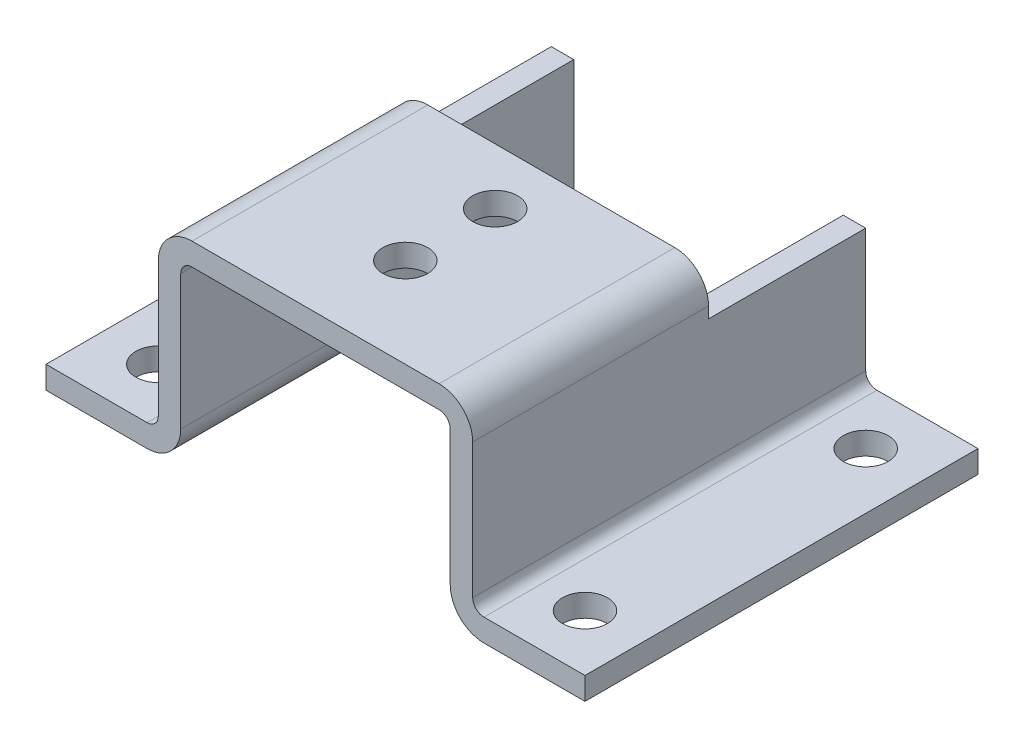
ISO-10303-21;
HEADER;
FILE_DESCRIPTION(('STEP AP214'),'2;1');
FILE_NAME('part.step','',(''),(''),'','','');
FILE_SCHEMA(('AUTOMOTIVE_DESIGN { 1 0 10303 214 1 1 1 1 }'));
ENDSEC;
DATA;
#1=APPLICATION_CONTEXT('core data for automotive mechanical design processes');
#2=APPLICATION_PROTOCOL_DEFINITION('international standard','automotive_design',2000,#1);
#3=PRODUCT_CONTEXT('',#1,'mechanical');
#4=PRODUCT('Part','Part','',(#3));
#5=PRODUCT_RELATED_PRODUCT_CATEGORY('part','',(#4));
#6=PRODUCT_DEFINITION_FORMATION('','',#4);
#7=PRODUCT_DEFINITION_CONTEXT('part definition',#1,'design');
#8=PRODUCT_DEFINITION('design','',#6,#7);
#9=PRODUCT_DEFINITION_SHAPE('','',#8);
#10=(LENGTH_UNIT() NAMED_UNIT(*) SI_UNIT(.MILLI.,.METRE.));
#11=(NAMED_UNIT(*) PLANE_ANGLE_UNIT() SI_UNIT($,.RADIAN.));
#12=(NAMED_UNIT(*) SI_UNIT($,.STERADIAN.) SOLID_ANGLE_UNIT());
#13=UNCERTAINTY_MEASURE_WITH_UNIT(LENGTH_MEASURE(1.E-05),#10,'distance_accuracy_value','');
#14=(GEOMETRIC_REPRESENTATION_CONTEXT(3) GLOBAL_UNCERTAINTY_ASSIGNED_CONTEXT((#13)) GLOBAL_UNIT_ASSIGNED_CONTEXT((#10,
#11,#12)) REPRESENTATION_CONTEXT('',''));
#15=CARTESIAN_POINT('',(0.,0.,0.));
#16=DIRECTION('',(0.,0.,1.));
#17=DIRECTION('',(1.,0.,0.));
#18=AXIS2_PLACEMENT_3D('',#15,#16,#17);
#19=CARTESIAN_POINT('',(9.,3.,0.));
#20=DIRECTION('',(0.,0.,1.));
#21=DIRECTION('',(1.,0.,0.));
#22=AXIS2_PLACEMENT_3D('',#19,#20,#21);
#23=PLANE('',#22);
#24=DIRECTION('',(-1.,0.,0.));
#25=VECTOR('',#24,1.);
#26=CARTESIAN_POINT('',(9.,14.,0.));
#27=LINE('',#26,#25);
#28=CARTESIAN_POINT('',(38.,14.,0.));
#29=VERTEX_POINT('',#28);
#30=CARTESIAN_POINT('',(36.,14.,0.));
#31=VERTEX_POINT('',#30);
#32=EDGE_CURVE('E54',#29,#31,#27,.T.);
#33=ORIENTED_EDGE('',*,*,#32,.F.);
#34=DIRECTION('',(0.,1.,0.));
#35=VECTOR('',#34,1.);
#36=CARTESIAN_POINT('',(38.,3.00000000000001,0.));
#37=LINE('',#36,#35);
#38=CARTESIAN_POINT('',(38.,3.00000000000001,0.));
#39=VERTEX_POINT('',#38);
#40=EDGE_CURVE('E228',#39,#29,#37,.T.);
#41=ORIENTED_EDGE('',*,*,#40,.F.);
#42=CARTESIAN_POINT('',(39.,3.00000000000001,0.));
#43=DIRECTION('',(0.,0.,-1.));
#44=DIRECTION('',(-1.,0.,0.));
#45=AXIS2_PLACEMENT_3D('',#42,#43,#44);
#46=CIRCLE('',#45,1.);
#47=CARTESIAN_POINT('',(39.,2.00000000000001,0.));
#48=VERTEX_POINT('',#47);
#49=EDGE_CURVE('E226',#48,#39,#46,.T.);
#50=ORIENTED_EDGE('',*,*,#49,.F.);
#51=DIRECTION('',(-1.,0.,0.));
#52=VECTOR('',#51,1.);
#53=CARTESIAN_POINT('',(48.,2.00000000000001,0.));
#54=LINE('',#53,#52);
#55=CARTESIAN_POINT('',(48.,2.00000000000001,0.));
#56=VERTEX_POINT('',#55);
#57=EDGE_CURVE('E224',#56,#48,#54,.T.);
#58=ORIENTED_EDGE('',*,*,#57,.F.);
#59=DIRECTION('',(0.,1.,0.));
#60=VECTOR('',#59,1.);
#61=CARTESIAN_POINT('',(48.,0.,0.));
#62=LINE('',#61,#60);
#63=CARTESIAN_POINT('',(48.,0.,0.));
#64=VERTEX_POINT('',#63);
#65=EDGE_CURVE('E222',#64,#56,#62,.T.);
#66=ORIENTED_EDGE('',*,*,#65,.F.);
#67=DIRECTION('',(1.,0.,0.));
#68=VECTOR('',#67,1.);
#69=CARTESIAN_POINT('',(39.,0.,0.));
#70=LINE('',#69,#68);
#71=CARTESIAN_POINT('',(39.,0.,0.));
#72=VERTEX_POINT('',#71);
#73=EDGE_CURVE('E220',#72,#64,#70,.T.);
#74=ORIENTED_EDGE('',*,*,#73,.F.);
#75=CARTESIAN_POINT('',(39.,3.00000000000001,0.));
#76=DIRECTION('',(0.,0.,1.));
#77=DIRECTION('',(-1.,0.,0.));
#78=AXIS2_PLACEMENT_3D('',#75,#76,#77);
#79=CIRCLE('',#78,3.);
#80=CARTESIAN_POINT('',(36.,3.00000000000001,0.));
#81=VERTEX_POINT('',#80);
#82=EDGE_CURVE('E218',#81,#72,#79,.T.);
#83=ORIENTED_EDGE('',*,*,#82,.F.);
#84=DIRECTION('',(0.,-1.,0.));
#85=VECTOR('',#84,1.);
#86=CARTESIAN_POINT('',(36.,15.,0.));
#87=LINE('',#86,#85);
#88=EDGE_CURVE('E216',#31,#81,#87,.T.);
#89=ORIENTED_EDGE('',*,*,#88,.F.);
#90=EDGE_LOOP('',(#33,#41,#50,#58,#66,#74,#83,#89));
#91=FACE_BOUND('',#90,.T.);
#92=ADVANCED_FACE('F45',(#91),#23,.F.);
#93=CARTESIAN_POINT('',(12.,14.,0.));
#94=VERTEX_POINT('',#93);
#95=CARTESIAN_POINT('',(10.,14.,0.));
#96=VERTEX_POINT('',#95);
#97=EDGE_CURVE('E286',#94,#96,#27,.T.);
#98=ORIENTED_EDGE('',*,*,#97,.F.);
#99=DIRECTION('',(0.,1.,0.));
#100=VECTOR('',#99,1.);
#101=CARTESIAN_POINT('',(12.,3.,0.));
#102=LINE('',#101,#100);
#103=CARTESIAN_POINT('',(12.,3.,0.));
#104=VERTEX_POINT('',#103);
#105=EDGE_CURVE('E213',#104,#94,#102,.T.);
#106=ORIENTED_EDGE('',*,*,#105,.F.);
#107=CARTESIAN_POINT('',(9.,3.,0.));
#108=DIRECTION('',(0.,0.,1.));
#109=DIRECTION('',(1.,0.,0.));
#110=AXIS2_PLACEMENT_3D('',#107,#108,#109);
#111=CIRCLE('',#110,3.);
#112=CARTESIAN_POINT('',(9.,0.,0.));
#113=VERTEX_POINT('',#112);
#114=EDGE_CURVE('E211',#113,#104,#111,.T.);
#115=ORIENTED_EDGE('',*,*,#114,.F.);
#116=DIRECTION('',(1.,0.,0.));
#117=VECTOR('',#116,1.);
#118=CARTESIAN_POINT('',(0.,0.,0.));
#119=LINE('',#118,#117);
#120=CARTESIAN_POINT('',(0.,0.,0.));
#121=VERTEX_POINT('',#120);
#122=EDGE_CURVE('E208',#121,#113,#119,.T.);
#123=ORIENTED_EDGE('',*,*,#122,.F.);
#124=DIRECTION('',(0.,-1.,0.));
#125=VECTOR('',#124,1.);
#126=CARTESIAN_POINT('',(0.,2.,0.));
#127=LINE('',#126,#125);
#128=CARTESIAN_POINT('',(0.,2.,0.));
#129=VERTEX_POINT('',#128);
#130=EDGE_CURVE('E205',#129,#121,#127,.T.);
#131=ORIENTED_EDGE('',*,*,#130,.F.);
#132=DIRECTION('',(-1.,0.,0.));
#133=VECTOR('',#132,1.);
#134=CARTESIAN_POINT('',(9.,2.,0.));
#135=LINE('',#134,#133);
#136=CARTESIAN_POINT('',(9.,2.,0.));
#137=VERTEX_POINT('',#136);
#138=EDGE_CURVE('E116',#137,#129,#135,.T.);
#139=ORIENTED_EDGE('',*,*,#138,.F.);
#140=CARTESIAN_POINT('',(9.,3.,0.));
#141=DIRECTION('',(0.,0.,-1.));
#142=DIRECTION('',(1.,0.,0.));
#143=AXIS2_PLACEMENT_3D('',#140,#141,#142);
#144=CIRCLE('',#143,1.);
#145=CARTESIAN_POINT('',(10.,3.,0.));
#146=VERTEX_POINT('',#145);
#147=EDGE_CURVE('E232',#146,#137,#144,.T.);
#148=ORIENTED_EDGE('',*,*,#147,.F.);
#149=DIRECTION('',(0.,-1.,0.));
#150=VECTOR('',#149,1.);
#151=CARTESIAN_POINT('',(10.,15.,0.));
#152=LINE('',#151,#150);
#153=EDGE_CURVE('E193',#96,#146,#152,.T.);
#154=ORIENTED_EDGE('',*,*,#153,.F.);
#155=EDGE_LOOP('',(#98,#106,#115,#123,#131,#139,#148,#154));
#156=FACE_BOUND('',#155,.T.);
#157=ADVANCED_FACE('F431',(#156),#23,.F.);
#158=CARTESIAN_POINT('',(0.,2.,35.));
#159=DIRECTION('',(1.,0.,0.));
#160=DIRECTION('',(0.,1.,0.));
#161=AXIS2_PLACEMENT_3D('',#158,#159,#160);
#162=PLANE('',#161);
#163=ORIENTED_EDGE('',*,*,#130,.T.);
#164=DIRECTION('',(0.,0.,-1.));
#165=VECTOR('',#164,1.);
#166=CARTESIAN_POINT('',(0.,0.,35.));
#167=LINE('',#166,#165);
#168=CARTESIAN_POINT('',(0.,0.,35.));
#169=VERTEX_POINT('',#168);
#170=EDGE_CURVE('E284',#169,#121,#167,.T.);
#171=ORIENTED_EDGE('',*,*,#170,.F.);
#172=DIRECTION('',(0.,-1.,0.));
#173=VECTOR('',#172,1.);
#174=CARTESIAN_POINT('',(0.,2.,35.));
#175=LINE('',#174,#173);
#176=CARTESIAN_POINT('',(0.,2.,35.));
#177=VERTEX_POINT('',#176);
#178=EDGE_CURVE('E235',#177,#169,#175,.T.);
#179=ORIENTED_EDGE('',*,*,#178,.F.);
#180=DIRECTION('',(0.,0.,-1.));
#181=VECTOR('',#180,1.);
#182=CARTESIAN_POINT('',(0.,2.,35.));
#183=LINE('',#182,#181);
#184=EDGE_CURVE('E201',#177,#129,#183,.T.);
#185=ORIENTED_EDGE('',*,*,#184,.T.);
#186=EDGE_LOOP('',(#163,#171,#179,#185));
#187=FACE_BOUND('',#186,.T.);
#188=ADVANCED_FACE('F47',(#187),#162,.F.);
#189=CARTESIAN_POINT('',(0.,0.,35.));
#190=DIRECTION('',(0.,1.,0.));
#191=DIRECTION('',(-1.,0.,0.));
#192=AXIS2_PLACEMENT_3D('',#189,#190,#191);
#193=PLANE('',#192);
#194=CARTESIAN_POINT('',(4.99999999999999,0.,5.));
#195=DIRECTION('',(0.,1.,0.));
#196=DIRECTION('',(-1.,0.,0.));
#197=AXIS2_PLACEMENT_3D('',#194,#195,#196);
#198=CIRCLE('',#197,2.);
#199=CARTESIAN_POINT('',(2.99999999999999,0.,5.));
#200=VERTEX_POINT('',#199);
#201=EDGE_CURVE('E708',#200,#200,#198,.T.);
#202=ORIENTED_EDGE('',*,*,#201,.T.);
#203=EDGE_LOOP('',(#202));
#204=FACE_BOUND('',#203,.T.);
#205=CARTESIAN_POINT('',(5.,0.,30.));
#206=DIRECTION('',(0.,1.,0.));
#207=DIRECTION('',(-1.,0.,0.));
#208=AXIS2_PLACEMENT_3D('',#205,#206,#207);
#209=CIRCLE('',#208,2.);
#210=CARTESIAN_POINT('',(2.99999999999999,0.,30.));
#211=VERTEX_POINT('',#210);
#212=EDGE_CURVE('E712',#211,#211,#209,.T.);
#213=ORIENTED_EDGE('',*,*,#212,.T.);
#214=EDGE_LOOP('',(#213));
#215=FACE_BOUND('',#214,.T.);
#216=ORIENTED_EDGE('',*,*,#122,.T.);
#217=DIRECTION('',(0.,0.,-1.));
#218=VECTOR('',#217,1.);
#219=CARTESIAN_POINT('',(9.,0.,35.));
#220=LINE('',#219,#218);
#221=CARTESIAN_POINT('',(9.,0.,35.));
#222=VERTEX_POINT('',#221);
#223=EDGE_CURVE('E281',#222,#113,#220,.T.);
#224=ORIENTED_EDGE('',*,*,#223,.F.);
#225=DIRECTION('',(1.,0.,0.));
#226=VECTOR('',#225,1.);
#227=CARTESIAN_POINT('',(0.,0.,35.));
#228=LINE('',#227,#226);
#229=EDGE_CURVE('E125',#169,#222,#228,.T.);
#230=ORIENTED_EDGE('',*,*,#229,.F.);
#231=ORIENTED_EDGE('',*,*,#170,.T.);
#232=EDGE_LOOP('',(#216,#224,#230,#231));
#233=FACE_BOUND('',#232,.T.);
#234=ADVANCED_FACE('F565',(#204,#215,#233),#193,.F.);
#235=CARTESIAN_POINT('',(9.,3.,35.));
#236=DIRECTION('',(0.,0.,-1.));
#237=DIRECTION('',(-1.,0.,0.));
#238=AXIS2_PLACEMENT_3D('',#235,#236,#237);
#239=CYLINDRICAL_SURFACE('',#238,3.);
#240=ORIENTED_EDGE('',*,*,#114,.T.);
#241=DIRECTION('',(0.,0.,-1.));
#242=VECTOR('',#241,1.);
#243=CARTESIAN_POINT('',(12.,3.,35.));
#244=LINE('',#243,#242);
#245=CARTESIAN_POINT('',(12.,3.,35.));
#246=VERTEX_POINT('',#245);
#247=EDGE_CURVE('E278',#246,#104,#244,.T.);
#248=ORIENTED_EDGE('',*,*,#247,.F.);
#249=CARTESIAN_POINT('',(9.,3.,35.));
#250=DIRECTION('',(0.,0.,1.));
#251=DIRECTION('',(1.,0.,0.));
#252=AXIS2_PLACEMENT_3D('',#249,#250,#251);
#253=CIRCLE('',#252,3.);
#254=EDGE_CURVE('E351',#222,#246,#253,.T.);
#255=ORIENTED_EDGE('',*,*,#254,.F.);
#256=ORIENTED_EDGE('',*,*,#223,.T.);
#257=EDGE_LOOP('',(#240,#248,#255,#256));
#258=FACE_BOUND('',#257,.T.);
#259=ADVANCED_FACE('F568',(#258),#239,.T.);
#260=CARTESIAN_POINT('',(12.,3.,35.));
#261=DIRECTION('',(-1.,0.,0.));
#262=DIRECTION('',(0.,-1.,0.));
#263=AXIS2_PLACEMENT_3D('',#260,#261,#262);
#264=PLANE('',#263);
#265=DIRECTION('',(0.,0.,-1.));
#266=VECTOR('',#265,1.);
#267=CARTESIAN_POINT('',(12.,14.,35.));
#268=LINE('',#267,#266);
#269=CARTESIAN_POINT('',(12.,14.,14.));
#270=VERTEX_POINT('',#269);
#271=EDGE_CURVE('E62',#270,#94,#268,.T.);
#272=ORIENTED_EDGE('',*,*,#271,.F.);
#273=DIRECTION('',(0.,1.,0.));
#274=VECTOR('',#273,1.);
#275=CARTESIAN_POINT('',(12.,3.,14.));
#276=LINE('',#275,#274);
#277=CARTESIAN_POINT('',(12.,15.,14.));
#278=VERTEX_POINT('',#277);
#279=EDGE_CURVE('E209',#270,#278,#276,.T.);
#280=ORIENTED_EDGE('',*,*,#279,.T.);
#281=DIRECTION('',(0.,0.,-1.));
#282=VECTOR('',#281,1.);
#283=CARTESIAN_POINT('',(12.,15.,35.));
#284=LINE('',#283,#282);
#285=CARTESIAN_POINT('',(12.,15.,35.));
#286=VERTEX_POINT('',#285);
#287=EDGE_CURVE('E275',#286,#278,#284,.T.);
#288=ORIENTED_EDGE('',*,*,#287,.F.);
#289=DIRECTION('',(0.,1.,0.));
#290=VECTOR('',#289,1.);
#291=CARTESIAN_POINT('',(12.,3.,35.));
#292=LINE('',#291,#290);
#293=EDGE_CURVE('E353',#246,#286,#292,.T.);
#294=ORIENTED_EDGE('',*,*,#293,.F.);
#295=ORIENTED_EDGE('',*,*,#247,.T.);
#296=ORIENTED_EDGE('',*,*,#105,.T.);
#297=EDGE_LOOP('',(#272,#280,#288,#294,#295,#296));
#298=FACE_BOUND('',#297,.T.);
#299=ADVANCED_FACE('F419',(#298),#264,.F.);
#300=CARTESIAN_POINT('',(13.,15.,35.));
#301=DIRECTION('',(0.,0.,-1.));
#302=DIRECTION('',(-1.,0.,0.));
#303=AXIS2_PLACEMENT_3D('',#300,#301,#302);
#304=CYLINDRICAL_SURFACE('',#303,1.);
#305=ORIENTED_EDGE('',*,*,#287,.T.);
#306=CARTESIAN_POINT('',(13.,15.,14.));
#307=DIRECTION('',(0.,0.,1.));
#308=DIRECTION('',(1.,0.,0.));
#309=AXIS2_PLACEMENT_3D('',#306,#307,#308);
#310=CIRCLE('',#309,1.);
#311=CARTESIAN_POINT('',(13.,16.,14.));
#312=VERTEX_POINT('',#311);
#313=EDGE_CURVE('E344',#278,#312,#310,.F.);
#314=ORIENTED_EDGE('',*,*,#313,.T.);
#315=DIRECTION('',(0.,0.,-1.));
#316=VECTOR('',#315,1.);
#317=CARTESIAN_POINT('',(13.,16.,35.));
#318=LINE('',#317,#316);
#319=CARTESIAN_POINT('',(13.,16.,35.));
#320=VERTEX_POINT('',#319);
#321=EDGE_CURVE('E272',#320,#312,#318,.T.);
#322=ORIENTED_EDGE('',*,*,#321,.F.);
#323=CARTESIAN_POINT('',(13.,15.,35.));
#324=DIRECTION('',(0.,0.,-1.));
#325=DIRECTION('',(1.,0.,0.));
#326=AXIS2_PLACEMENT_3D('',#323,#324,#325);
#327=CIRCLE('',#326,1.);
#328=EDGE_CURVE('E355',#286,#320,#327,.T.);
#329=ORIENTED_EDGE('',*,*,#328,.F.);
#330=EDGE_LOOP('',(#305,#314,#322,#329));
#331=FACE_BOUND('',#330,.T.);
#332=ADVANCED_FACE('F422',(#331),#304,.F.);
#333=CARTESIAN_POINT('',(13.,16.,35.));
#334=DIRECTION('',(0.,1.,0.));
#335=DIRECTION('',(-1.,0.,0.));
#336=AXIS2_PLACEMENT_3D('',#333,#334,#335);
#337=PLANE('',#336);
#338=CARTESIAN_POINT('',(24.,16.,27.));
#339=DIRECTION('',(0.,1.,0.));
#340=DIRECTION('',(-1.,0.,0.));
#341=AXIS2_PLACEMENT_3D('',#338,#339,#340);
#342=CIRCLE('',#341,2.);
#343=CARTESIAN_POINT('',(22.,16.,27.));
#344=VERTEX_POINT('',#343);
#345=EDGE_CURVE('E297',#344,#344,#342,.T.);
#346=ORIENTED_EDGE('',*,*,#345,.T.);
#347=EDGE_LOOP('',(#346));
#348=FACE_BOUND('',#347,.T.);
#349=CARTESIAN_POINT('',(24.,16.,19.));
#350=DIRECTION('',(0.,1.,0.));
#351=DIRECTION('',(-1.,0.,0.));
#352=AXIS2_PLACEMENT_3D('',#349,#350,#351);
#353=CIRCLE('',#352,2.);
#354=CARTESIAN_POINT('',(22.,16.,19.));
#355=VERTEX_POINT('',#354);
#356=EDGE_CURVE('E294',#355,#355,#353,.T.);
#357=ORIENTED_EDGE('',*,*,#356,.T.);
#358=EDGE_LOOP('',(#357));
#359=FACE_BOUND('',#358,.T.);
#360=ORIENTED_EDGE('',*,*,#321,.T.);
#361=DIRECTION('',(1.,0.,0.));
#362=VECTOR('',#361,1.);
#363=CARTESIAN_POINT('',(13.,16.,14.));
#364=LINE('',#363,#362);
#365=CARTESIAN_POINT('',(35.,16.,14.));
#366=VERTEX_POINT('',#365);
#367=EDGE_CURVE('E341',#312,#366,#364,.T.);
#368=ORIENTED_EDGE('',*,*,#367,.T.);
#369=DIRECTION('',(0.,0.,-1.));
#370=VECTOR('',#369,1.);
#371=CARTESIAN_POINT('',(35.,16.,35.));
#372=LINE('',#371,#370);
#373=CARTESIAN_POINT('',(35.,16.,35.));
#374=VERTEX_POINT('',#373);
#375=EDGE_CURVE('E269',#374,#366,#372,.T.);
#376=ORIENTED_EDGE('',*,*,#375,.F.);
#377=DIRECTION('',(1.,0.,0.));
#378=VECTOR('',#377,1.);
#379=CARTESIAN_POINT('',(13.,16.,35.));
#380=LINE('',#379,#378);
#381=EDGE_CURVE('E357',#320,#374,#380,.T.);
#382=ORIENTED_EDGE('',*,*,#381,.F.);
#383=EDGE_LOOP('',(#360,#368,#376,#382));
#384=FACE_BOUND('',#383,.T.);
#385=ADVANCED_FACE('F458',(#348,#359,#384),#337,.F.);
#386=CARTESIAN_POINT('',(35.,15.,35.));
#387=DIRECTION('',(0.,0.,-1.));
#388=DIRECTION('',(-1.,0.,0.));
#389=AXIS2_PLACEMENT_3D('',#386,#387,#388);
#390=CYLINDRICAL_SURFACE('',#389,1.);
#391=ORIENTED_EDGE('',*,*,#375,.T.);
#392=CARTESIAN_POINT('',(35.,15.,14.));
#393=DIRECTION('',(0.,0.,1.));
#394=DIRECTION('',(1.,0.,0.));
#395=AXIS2_PLACEMENT_3D('',#392,#393,#394);
#396=CIRCLE('',#395,1.);
#397=CARTESIAN_POINT('',(36.,15.,14.));
#398=VERTEX_POINT('',#397);
#399=EDGE_CURVE('E338',#366,#398,#396,.F.);
#400=ORIENTED_EDGE('',*,*,#399,.T.);
#401=DIRECTION('',(0.,0.,-1.));
#402=VECTOR('',#401,1.);
#403=CARTESIAN_POINT('',(36.,15.,35.));
#404=LINE('',#403,#402);
#405=CARTESIAN_POINT('',(36.,15.,35.));
#406=VERTEX_POINT('',#405);
#407=EDGE_CURVE('E266',#406,#398,#404,.T.);
#408=ORIENTED_EDGE('',*,*,#407,.F.);
#409=CARTESIAN_POINT('',(35.,15.,35.));
#410=DIRECTION('',(0.,0.,-1.));
#411=DIRECTION('',(-1.,0.,0.));
#412=AXIS2_PLACEMENT_3D('',#409,#410,#411);
#413=CIRCLE('',#412,1.);
#414=EDGE_CURVE('E359',#374,#406,#413,.T.);
#415=ORIENTED_EDGE('',*,*,#414,.F.);
#416=EDGE_LOOP('',(#391,#400,#408,#415));
#417=FACE_BOUND('',#416,.T.);
#418=ADVANCED_FACE('F456',(#417),#390,.F.);
#419=CARTESIAN_POINT('',(36.,15.,35.));
#420=DIRECTION('',(1.,0.,0.));
#421=DIRECTION('',(0.,1.,0.));
#422=AXIS2_PLACEMENT_3D('',#419,#420,#421);
#423=PLANE('',#422);
#424=ORIENTED_EDGE('',*,*,#407,.T.);
#425=DIRECTION('',(0.,-1.,0.));
#426=VECTOR('',#425,1.);
#427=CARTESIAN_POINT('',(36.,15.,14.));
#428=LINE('',#427,#426);
#429=CARTESIAN_POINT('',(36.,14.,14.));
#430=VERTEX_POINT('',#429);
#431=EDGE_CURVE('E335',#398,#430,#428,.T.);
#432=ORIENTED_EDGE('',*,*,#431,.T.);
#433=DIRECTION('',(0.,0.,1.));
#434=VECTOR('',#433,1.);
#435=CARTESIAN_POINT('',(36.,14.,35.));
#436=LINE('',#435,#434);
#437=EDGE_CURVE('E322',#31,#430,#436,.T.);
#438=ORIENTED_EDGE('',*,*,#437,.F.);
#439=ORIENTED_EDGE('',*,*,#88,.T.);
#440=DIRECTION('',(0.,0.,-1.));
#441=VECTOR('',#440,1.);
#442=CARTESIAN_POINT('',(36.,3.00000000000001,35.));
#443=LINE('',#442,#441);
#444=CARTESIAN_POINT('',(36.,3.00000000000001,35.));
#445=VERTEX_POINT('',#444);
#446=EDGE_CURVE('E263',#445,#81,#443,.T.);
#447=ORIENTED_EDGE('',*,*,#446,.F.);
#448=DIRECTION('',(0.,-1.,0.));
#449=VECTOR('',#448,1.);
#450=CARTESIAN_POINT('',(36.,15.,35.));
#451=LINE('',#450,#449);
#452=EDGE_CURVE('E361',#406,#445,#451,.T.);
#453=ORIENTED_EDGE('',*,*,#452,.F.);
#454=EDGE_LOOP('',(#424,#432,#438,#439,#447,#453));
#455=FACE_BOUND('',#454,.T.);
#456=ADVANCED_FACE('F450',(#455),#423,.F.);
#457=CARTESIAN_POINT('',(39.,3.00000000000001,35.));
#458=DIRECTION('',(0.,0.,-1.));
#459=DIRECTION('',(-1.,0.,0.));
#460=AXIS2_PLACEMENT_3D('',#457,#458,#459);
#461=CYLINDRICAL_SURFACE('',#460,3.);
#462=ORIENTED_EDGE('',*,*,#82,.T.);
#463=DIRECTION('',(0.,0.,-1.));
#464=VECTOR('',#463,1.);
#465=CARTESIAN_POINT('',(39.,0.,35.));
#466=LINE('',#465,#464);
#467=CARTESIAN_POINT('',(39.,0.,35.));
#468=VERTEX_POINT('',#467);
#469=EDGE_CURVE('E260',#468,#72,#466,.T.);
#470=ORIENTED_EDGE('',*,*,#469,.F.);
#471=CARTESIAN_POINT('',(39.,3.00000000000001,35.));
#472=DIRECTION('',(0.,0.,1.));
#473=DIRECTION('',(-1.,0.,0.));
#474=AXIS2_PLACEMENT_3D('',#471,#472,#473);
#475=CIRCLE('',#474,3.);
#476=EDGE_CURVE('E363',#445,#468,#475,.T.);
#477=ORIENTED_EDGE('',*,*,#476,.F.);
#478=ORIENTED_EDGE('',*,*,#446,.T.);
#479=EDGE_LOOP('',(#462,#470,#477,#478));
#480=FACE_BOUND('',#479,.T.);
#481=ADVANCED_FACE('F515',(#480),#461,.T.);
#482=CARTESIAN_POINT('',(39.,0.,35.));
#483=DIRECTION('',(0.,1.,0.));
#484=DIRECTION('',(-1.,0.,0.));
#485=AXIS2_PLACEMENT_3D('',#482,#483,#484);
#486=PLANE('',#485);
#487=CARTESIAN_POINT('',(43.,0.,30.));
#488=DIRECTION('',(0.,1.,0.));
#489=DIRECTION('',(1.,0.,0.));
#490=AXIS2_PLACEMENT_3D('',#487,#488,#489);
#491=CIRCLE('',#490,2.);
#492=CARTESIAN_POINT('',(45.,0.,30.));
#493=VERTEX_POINT('',#492);
#494=EDGE_CURVE('E683',#493,#493,#491,.T.);
#495=ORIENTED_EDGE('',*,*,#494,.T.);
#496=EDGE_LOOP('',(#495));
#497=FACE_BOUND('',#496,.T.);
#498=CARTESIAN_POINT('',(43.,0.,5.));
#499=DIRECTION('',(0.,1.,0.));
#500=DIRECTION('',(1.,0.,0.));
#501=AXIS2_PLACEMENT_3D('',#498,#499,#500);
#502=CIRCLE('',#501,2.);
#503=CARTESIAN_POINT('',(45.,0.,5.));
#504=VERTEX_POINT('',#503);
#505=EDGE_CURVE('E709',#504,#504,#502,.T.);
#506=ORIENTED_EDGE('',*,*,#505,.T.);
#507=EDGE_LOOP('',(#506));
#508=FACE_BOUND('',#507,.T.);
#509=ORIENTED_EDGE('',*,*,#73,.T.);
#510=DIRECTION('',(0.,0.,-1.));
#511=VECTOR('',#510,1.);
#512=CARTESIAN_POINT('',(48.,0.,35.));
#513=LINE('',#512,#511);
#514=CARTESIAN_POINT('',(48.,0.,35.));
#515=VERTEX_POINT('',#514);
#516=EDGE_CURVE('E257',#515,#64,#513,.T.);
#517=ORIENTED_EDGE('',*,*,#516,.F.);
#518=DIRECTION('',(1.,0.,0.));
#519=VECTOR('',#518,1.);
#520=CARTESIAN_POINT('',(39.,0.,35.));
#521=LINE('',#520,#519);
#522=EDGE_CURVE('E365',#468,#515,#521,.T.);
#523=ORIENTED_EDGE('',*,*,#522,.F.);
#524=ORIENTED_EDGE('',*,*,#469,.T.);
#525=EDGE_LOOP('',(#509,#517,#523,#524));
#526=FACE_BOUND('',#525,.T.);
#527=ADVANCED_FACE('F512',(#497,#508,#526),#486,.F.);
#528=CARTESIAN_POINT('',(48.,0.,35.));
#529=DIRECTION('',(-1.,0.,0.));
#530=DIRECTION('',(0.,0.,1.));
#531=AXIS2_PLACEMENT_3D('',#528,#529,#530);
#532=PLANE('',#531);
#533=ORIENTED_EDGE('',*,*,#65,.T.);
#534=DIRECTION('',(0.,0.,-1.));
#535=VECTOR('',#534,1.);
#536=CARTESIAN_POINT('',(48.,2.00000000000001,35.));
#537=LINE('',#536,#535);
#538=CARTESIAN_POINT('',(48.,2.00000000000001,35.));
#539=VERTEX_POINT('',#538);
#540=EDGE_CURVE('E254',#539,#56,#537,.T.);
#541=ORIENTED_EDGE('',*,*,#540,.F.);
#542=DIRECTION('',(0.,1.,0.));
#543=VECTOR('',#542,1.);
#544=CARTESIAN_POINT('',(48.,0.,35.));
#545=LINE('',#544,#543);
#546=EDGE_CURVE('E367',#515,#539,#545,.T.);
#547=ORIENTED_EDGE('',*,*,#546,.F.);
#548=ORIENTED_EDGE('',*,*,#516,.T.);
#549=EDGE_LOOP('',(#533,#541,#547,#548));
#550=FACE_BOUND('',#549,.T.);
#551=ADVANCED_FACE('F508',(#550),#532,.F.);
#552=CARTESIAN_POINT('',(48.,2.00000000000001,35.));
#553=DIRECTION('',(0.,-1.,0.));
#554=DIRECTION('',(1.,0.,0.));
#555=AXIS2_PLACEMENT_3D('',#552,#553,#554);
#556=PLANE('',#555);
#557=CARTESIAN_POINT('',(43.,2.00000000000001,30.));
#558=DIRECTION('',(0.,-1.,0.));
#559=DIRECTION('',(1.,0.,0.));
#560=AXIS2_PLACEMENT_3D('',#557,#558,#559);
#561=CIRCLE('',#560,2.);
#562=CARTESIAN_POINT('',(45.,2.00000000000001,30.));
#563=VERTEX_POINT('',#562);
#564=EDGE_CURVE('E49',#563,#563,#561,.T.);
#565=ORIENTED_EDGE('',*,*,#564,.T.);
#566=EDGE_LOOP('',(#565));
#567=FACE_BOUND('',#566,.T.);
#568=CARTESIAN_POINT('',(43.,2.00000000000001,5.));
#569=DIRECTION('',(0.,-1.,0.));
#570=DIRECTION('',(1.,0.,0.));
#571=AXIS2_PLACEMENT_3D('',#568,#569,#570);
#572=CIRCLE('',#571,2.);
#573=CARTESIAN_POINT('',(45.,2.00000000000001,5.));
#574=VERTEX_POINT('',#573);
#575=EDGE_CURVE('E295',#574,#574,#572,.T.);
#576=ORIENTED_EDGE('',*,*,#575,.T.);
#577=EDGE_LOOP('',(#576));
#578=FACE_BOUND('',#577,.T.);
#579=ORIENTED_EDGE('',*,*,#57,.T.);
#580=DIRECTION('',(0.,0.,-1.));
#581=VECTOR('',#580,1.);
#582=CARTESIAN_POINT('',(39.,2.00000000000001,35.));
#583=LINE('',#582,#581);
#584=CARTESIAN_POINT('',(39.,2.00000000000001,35.));
#585=VERTEX_POINT('',#584);
#586=EDGE_CURVE('E251',#585,#48,#583,.T.);
#587=ORIENTED_EDGE('',*,*,#586,.F.);
#588=DIRECTION('',(-1.,0.,0.));
#589=VECTOR('',#588,1.);
#590=CARTESIAN_POINT('',(48.,2.00000000000001,35.));
#591=LINE('',#590,#589);
#592=EDGE_CURVE('E369',#539,#585,#591,.T.);
#593=ORIENTED_EDGE('',*,*,#592,.F.);
#594=ORIENTED_EDGE('',*,*,#540,.T.);
#595=EDGE_LOOP('',(#579,#587,#593,#594));
#596=FACE_BOUND('',#595,.T.);
#597=ADVANCED_FACE('F504',(#567,#578,#596),#556,.F.);
#598=CARTESIAN_POINT('',(39.,3.00000000000001,35.));
#599=DIRECTION('',(0.,0.,-1.));
#600=DIRECTION('',(-1.,0.,0.));
#601=AXIS2_PLACEMENT_3D('',#598,#599,#600);
#602=CYLINDRICAL_SURFACE('',#601,1.);
#603=ORIENTED_EDGE('',*,*,#49,.T.);
#604=DIRECTION('',(0.,0.,-1.));
#605=VECTOR('',#604,1.);
#606=CARTESIAN_POINT('',(38.,3.00000000000001,35.));
#607=LINE('',#606,#605);
#608=CARTESIAN_POINT('',(38.,3.00000000000001,35.));
#609=VERTEX_POINT('',#608);
#610=EDGE_CURVE('E248',#609,#39,#607,.T.);
#611=ORIENTED_EDGE('',*,*,#610,.F.);
#612=CARTESIAN_POINT('',(39.,3.00000000000001,35.));
#613=DIRECTION('',(0.,0.,-1.));
#614=DIRECTION('',(-1.,0.,0.));
#615=AXIS2_PLACEMENT_3D('',#612,#613,#614);
#616=CIRCLE('',#615,1.);
#617=EDGE_CURVE('E371',#585,#609,#616,.T.);
#618=ORIENTED_EDGE('',*,*,#617,.F.);
#619=ORIENTED_EDGE('',*,*,#586,.T.);
#620=EDGE_LOOP('',(#603,#611,#618,#619));
#621=FACE_BOUND('',#620,.T.);
#622=ADVANCED_FACE('F500',(#621),#602,.F.);
#623=CARTESIAN_POINT('',(38.,3.00000000000001,35.));
#624=DIRECTION('',(-1.,0.,0.));
#625=DIRECTION('',(0.,-1.,0.));
#626=AXIS2_PLACEMENT_3D('',#623,#624,#625);
#627=PLANE('',#626);
#628=DIRECTION('',(0.,0.,-1.));
#629=VECTOR('',#628,1.);
#630=CARTESIAN_POINT('',(38.,14.,35.));
#631=LINE('',#630,#629);
#632=CARTESIAN_POINT('',(38.,14.,14.));
#633=VERTEX_POINT('',#632);
#634=EDGE_CURVE('E319',#633,#29,#631,.T.);
#635=ORIENTED_EDGE('',*,*,#634,.F.);
#636=DIRECTION('',(0.,1.,0.));
#637=VECTOR('',#636,1.);
#638=CARTESIAN_POINT('',(38.,3.00000000000001,14.));
#639=LINE('',#638,#637);
#640=CARTESIAN_POINT('',(38.,15.,14.));
#641=VERTEX_POINT('',#640);
#642=EDGE_CURVE('E332',#633,#641,#639,.T.);
#643=ORIENTED_EDGE('',*,*,#642,.T.);
#644=DIRECTION('',(0.,0.,-1.));
#645=VECTOR('',#644,1.);
#646=CARTESIAN_POINT('',(38.,15.,35.));
#647=LINE('',#646,#645);
#648=CARTESIAN_POINT('',(38.,15.,35.));
#649=VERTEX_POINT('',#648);
#650=EDGE_CURVE('E245',#649,#641,#647,.T.);
#651=ORIENTED_EDGE('',*,*,#650,.F.);
#652=DIRECTION('',(0.,1.,0.));
#653=VECTOR('',#652,1.);
#654=CARTESIAN_POINT('',(38.,3.00000000000001,35.));
#655=LINE('',#654,#653);
#656=EDGE_CURVE('E373',#609,#649,#655,.T.);
#657=ORIENTED_EDGE('',*,*,#656,.F.);
#658=ORIENTED_EDGE('',*,*,#610,.T.);
#659=ORIENTED_EDGE('',*,*,#40,.T.);
#660=EDGE_LOOP('',(#635,#643,#651,#657,#658,#659));
#661=FACE_BOUND('',#660,.T.);
#662=ADVANCED_FACE('F496',(#661),#627,.F.);
#663=CARTESIAN_POINT('',(35.,15.,35.));
#664=DIRECTION('',(0.,0.,-1.));
#665=DIRECTION('',(-1.,0.,0.));
#666=AXIS2_PLACEMENT_3D('',#663,#664,#665);
#667=CYLINDRICAL_SURFACE('',#666,3.);
#668=ORIENTED_EDGE('',*,*,#650,.T.);
#669=CARTESIAN_POINT('',(35.,15.,14.));
#670=DIRECTION('',(0.,0.,1.));
#671=DIRECTION('',(1.,0.,0.));
#672=AXIS2_PLACEMENT_3D('',#669,#670,#671);
#673=CIRCLE('',#672,3.);
#674=CARTESIAN_POINT('',(35.,18.,14.));
#675=VERTEX_POINT('',#674);
#676=EDGE_CURVE('E329',#641,#675,#673,.T.);
#677=ORIENTED_EDGE('',*,*,#676,.T.);
#678=DIRECTION('',(0.,0.,-1.));
#679=VECTOR('',#678,1.);
#680=CARTESIAN_POINT('',(35.,18.,35.));
#681=LINE('',#680,#679);
#682=CARTESIAN_POINT('',(35.,18.,35.));
#683=VERTEX_POINT('',#682);
#684=EDGE_CURVE('E242',#683,#675,#681,.T.);
#685=ORIENTED_EDGE('',*,*,#684,.F.);
#686=CARTESIAN_POINT('',(35.,15.,35.));
#687=DIRECTION('',(0.,0.,1.));
#688=DIRECTION('',(-1.,0.,0.));
#689=AXIS2_PLACEMENT_3D('',#686,#687,#688);
#690=CIRCLE('',#689,3.);
#691=EDGE_CURVE('E375',#649,#683,#690,.T.);
#692=ORIENTED_EDGE('',*,*,#691,.F.);
#693=EDGE_LOOP('',(#668,#677,#685,#692));
#694=FACE_BOUND('',#693,.T.);
#695=ADVANCED_FACE('F492',(#694),#667,.T.);
#696=CARTESIAN_POINT('',(35.,18.,35.));
#697=DIRECTION('',(0.,-1.,0.));
#698=DIRECTION('',(1.,0.,0.));
#699=AXIS2_PLACEMENT_3D('',#696,#697,#698);
#700=PLANE('',#699);
#701=CARTESIAN_POINT('',(24.,18.,27.));
#702=DIRECTION('',(0.,1.,0.));
#703=DIRECTION('',(-1.,0.,0.));
#704=AXIS2_PLACEMENT_3D('',#701,#702,#703);
#705=CIRCLE('',#704,2.);
#706=CARTESIAN_POINT('',(22.,18.,27.));
#707=VERTEX_POINT('',#706);
#708=EDGE_CURVE('E717',#707,#707,#705,.T.);
#709=ORIENTED_EDGE('',*,*,#708,.F.);
#710=EDGE_LOOP('',(#709));
#711=FACE_BOUND('',#710,.T.);
#712=CARTESIAN_POINT('',(24.,18.,19.));
#713=DIRECTION('',(0.,1.,0.));
#714=DIRECTION('',(-1.,0.,0.));
#715=AXIS2_PLACEMENT_3D('',#712,#713,#714);
#716=CIRCLE('',#715,2.);
#717=CARTESIAN_POINT('',(22.,18.,19.));
#718=VERTEX_POINT('',#717);
#719=EDGE_CURVE('E292',#718,#718,#716,.T.);
#720=ORIENTED_EDGE('',*,*,#719,.F.);
#721=EDGE_LOOP('',(#720));
#722=FACE_BOUND('',#721,.T.);
#723=ORIENTED_EDGE('',*,*,#684,.T.);
#724=DIRECTION('',(1.,0.,0.));
#725=VECTOR('',#724,1.);
#726=CARTESIAN_POINT('',(0.,18.,14.));
#727=LINE('',#726,#725);
#728=CARTESIAN_POINT('',(13.,18.,14.));
#729=VERTEX_POINT('',#728);
#730=EDGE_CURVE('E301',#729,#675,#727,.T.);
#731=ORIENTED_EDGE('',*,*,#730,.F.);
#732=DIRECTION('',(0.,0.,-1.));
#733=VECTOR('',#732,1.);
#734=CARTESIAN_POINT('',(13.,18.,35.));
#735=LINE('',#734,#733);
#736=CARTESIAN_POINT('',(13.,18.,35.));
#737=VERTEX_POINT('',#736);
#738=EDGE_CURVE('E239',#737,#729,#735,.T.);
#739=ORIENTED_EDGE('',*,*,#738,.F.);
#740=DIRECTION('',(-1.,0.,0.));
#741=VECTOR('',#740,1.);
#742=CARTESIAN_POINT('',(35.,18.,35.));
#743=LINE('',#742,#741);
#744=EDGE_CURVE('E377',#683,#737,#743,.T.);
#745=ORIENTED_EDGE('',*,*,#744,.F.);
#746=EDGE_LOOP('',(#723,#731,#739,#745));
#747=FACE_BOUND('',#746,.T.);
#748=ADVANCED_FACE('F384',(#711,#722,#747),#700,.F.);
#749=CARTESIAN_POINT('',(13.,15.,35.));
#750=DIRECTION('',(0.,0.,-1.));
#751=DIRECTION('',(-1.,0.,0.));
#752=AXIS2_PLACEMENT_3D('',#749,#750,#751);
#753=CYLINDRICAL_SURFACE('',#752,3.);
#754=ORIENTED_EDGE('',*,*,#738,.T.);
#755=CARTESIAN_POINT('',(13.,15.,14.));
#756=DIRECTION('',(0.,0.,1.));
#757=DIRECTION('',(1.,0.,0.));
#758=AXIS2_PLACEMENT_3D('',#755,#756,#757);
#759=CIRCLE('',#758,3.);
#760=CARTESIAN_POINT('',(10.,15.,14.));
#761=VERTEX_POINT('',#760);
#762=EDGE_CURVE('E326',#729,#761,#759,.T.);
#763=ORIENTED_EDGE('',*,*,#762,.T.);
#764=DIRECTION('',(0.,0.,-1.));
#765=VECTOR('',#764,1.);
#766=CARTESIAN_POINT('',(10.,15.,35.));
#767=LINE('',#766,#765);
#768=CARTESIAN_POINT('',(10.,15.,35.));
#769=VERTEX_POINT('',#768);
#770=EDGE_CURVE('E196',#769,#761,#767,.T.);
#771=ORIENTED_EDGE('',*,*,#770,.F.);
#772=CARTESIAN_POINT('',(13.,15.,35.));
#773=DIRECTION('',(0.,0.,1.));
#774=DIRECTION('',(1.,0.,0.));
#775=AXIS2_PLACEMENT_3D('',#772,#773,#774);
#776=CIRCLE('',#775,3.);
#777=EDGE_CURVE('E183',#737,#769,#776,.T.);
#778=ORIENTED_EDGE('',*,*,#777,.F.);
#779=EDGE_LOOP('',(#754,#763,#771,#778));
#780=FACE_BOUND('',#779,.T.);
#781=ADVANCED_FACE('F387',(#780),#753,.T.);
#782=CARTESIAN_POINT('',(10.,15.,35.));
#783=DIRECTION('',(1.,0.,0.));
#784=DIRECTION('',(0.,1.,0.));
#785=AXIS2_PLACEMENT_3D('',#782,#783,#784);
#786=PLANE('',#785);
#787=ORIENTED_EDGE('',*,*,#770,.T.);
#788=DIRECTION('',(0.,-1.,0.));
#789=VECTOR('',#788,1.);
#790=CARTESIAN_POINT('',(10.,15.,14.));
#791=LINE('',#790,#789);
#792=CARTESIAN_POINT('',(10.,14.,14.));
#793=VERTEX_POINT('',#792);
#794=EDGE_CURVE('E11',#761,#793,#791,.T.);
#795=ORIENTED_EDGE('',*,*,#794,.T.);
#796=DIRECTION('',(0.,0.,1.));
#797=VECTOR('',#796,1.);
#798=CARTESIAN_POINT('',(10.,14.,35.));
#799=LINE('',#798,#797);
#800=EDGE_CURVE('E316',#96,#793,#799,.T.);
#801=ORIENTED_EDGE('',*,*,#800,.F.);
#802=ORIENTED_EDGE('',*,*,#153,.T.);
#803=DIRECTION('',(0.,0.,-1.));
#804=VECTOR('',#803,1.);
#805=CARTESIAN_POINT('',(10.,3.,35.));
#806=LINE('',#805,#804);
#807=CARTESIAN_POINT('',(10.,3.,35.));
#808=VERTEX_POINT('',#807);
#809=EDGE_CURVE('E189',#808,#146,#806,.T.);
#810=ORIENTED_EDGE('',*,*,#809,.F.);
#811=DIRECTION('',(0.,-1.,0.));
#812=VECTOR('',#811,1.);
#813=CARTESIAN_POINT('',(10.,15.,35.));
#814=LINE('',#813,#812);
#815=EDGE_CURVE('E176',#769,#808,#814,.T.);
#816=ORIENTED_EDGE('',*,*,#815,.F.);
#817=EDGE_LOOP('',(#787,#795,#801,#802,#810,#816));
#818=FACE_BOUND('',#817,.T.);
#819=ADVANCED_FACE('F190',(#818),#786,.F.);
#820=CARTESIAN_POINT('',(9.,3.,35.));
#821=DIRECTION('',(0.,0.,-1.));
#822=DIRECTION('',(-1.,0.,0.));
#823=AXIS2_PLACEMENT_3D('',#820,#821,#822);
#824=CYLINDRICAL_SURFACE('',#823,1.);
#825=ORIENTED_EDGE('',*,*,#147,.T.);
#826=DIRECTION('',(0.,0.,-1.));
#827=VECTOR('',#826,1.);
#828=CARTESIAN_POINT('',(9.,2.,35.));
#829=LINE('',#828,#827);
#830=CARTESIAN_POINT('',(9.,2.,35.));
#831=VERTEX_POINT('',#830);
#832=EDGE_CURVE('E197',#831,#137,#829,.T.);
#833=ORIENTED_EDGE('',*,*,#832,.F.);
#834=CARTESIAN_POINT('',(9.,3.,35.));
#835=DIRECTION('',(0.,0.,-1.));
#836=DIRECTION('',(1.,0.,0.));
#837=AXIS2_PLACEMENT_3D('',#834,#835,#836);
#838=CIRCLE('',#837,1.);
#839=EDGE_CURVE('E180',#808,#831,#838,.T.);
#840=ORIENTED_EDGE('',*,*,#839,.F.);
#841=ORIENTED_EDGE('',*,*,#809,.T.);
#842=EDGE_LOOP('',(#825,#833,#840,#841));
#843=FACE_BOUND('',#842,.T.);
#844=ADVANCED_FACE('F199',(#843),#824,.F.);
#845=CARTESIAN_POINT('',(9.,2.,35.));
#846=DIRECTION('',(0.,-1.,0.));
#847=DIRECTION('',(1.,0.,0.));
#848=AXIS2_PLACEMENT_3D('',#845,#846,#847);
#849=PLANE('',#848);
#850=CARTESIAN_POINT('',(4.99999999999999,2.,5.));
#851=DIRECTION('',(0.,-1.,0.));
#852=DIRECTION('',(1.,0.,0.));
#853=AXIS2_PLACEMENT_3D('',#850,#851,#852);
#854=CIRCLE('',#853,2.);
#855=CARTESIAN_POINT('',(6.99999999999999,2.,5.));
#856=VERTEX_POINT('',#855);
#857=EDGE_CURVE('E291',#856,#856,#854,.T.);
#858=ORIENTED_EDGE('',*,*,#857,.T.);
#859=EDGE_LOOP('',(#858));
#860=FACE_BOUND('',#859,.T.);
#861=CARTESIAN_POINT('',(5.,2.,30.));
#862=DIRECTION('',(0.,-1.,0.));
#863=DIRECTION('',(1.,0.,0.));
#864=AXIS2_PLACEMENT_3D('',#861,#862,#863);
#865=CIRCLE('',#864,2.);
#866=CARTESIAN_POINT('',(7.,2.,30.));
#867=VERTEX_POINT('',#866);
#868=EDGE_CURVE('E288',#867,#867,#865,.T.);
#869=ORIENTED_EDGE('',*,*,#868,.T.);
#870=EDGE_LOOP('',(#869));
#871=FACE_BOUND('',#870,.T.);
#872=ORIENTED_EDGE('',*,*,#138,.T.);
#873=ORIENTED_EDGE('',*,*,#184,.F.);
#874=DIRECTION('',(-1.,0.,0.));
#875=VECTOR('',#874,1.);
#876=CARTESIAN_POINT('',(9.,2.,35.));
#877=LINE('',#876,#875);
#878=EDGE_CURVE('E71',#831,#177,#877,.T.);
#879=ORIENTED_EDGE('',*,*,#878,.F.);
#880=ORIENTED_EDGE('',*,*,#832,.T.);
#881=EDGE_LOOP('',(#872,#873,#879,#880));
#882=FACE_BOUND('',#881,.T.);
#883=ADVANCED_FACE('F480',(#860,#871,#882),#849,.F.);
#884=CARTESIAN_POINT('',(9.,3.,35.));
#885=DIRECTION('',(0.,0.,1.));
#886=DIRECTION('',(1.,0.,0.));
#887=AXIS2_PLACEMENT_3D('',#884,#885,#886);
#888=PLANE('',#887);
#889=ORIENTED_EDGE('',*,*,#178,.T.);
#890=ORIENTED_EDGE('',*,*,#229,.T.);
#891=ORIENTED_EDGE('',*,*,#254,.T.);
#892=ORIENTED_EDGE('',*,*,#293,.T.);
#893=ORIENTED_EDGE('',*,*,#328,.T.);
#894=ORIENTED_EDGE('',*,*,#381,.T.);
#895=ORIENTED_EDGE('',*,*,#414,.T.);
#896=ORIENTED_EDGE('',*,*,#452,.T.);
#897=ORIENTED_EDGE('',*,*,#476,.T.);
#898=ORIENTED_EDGE('',*,*,#522,.T.);
#899=ORIENTED_EDGE('',*,*,#546,.T.);
#900=ORIENTED_EDGE('',*,*,#592,.T.);
#901=ORIENTED_EDGE('',*,*,#617,.T.);
#902=ORIENTED_EDGE('',*,*,#656,.T.);
#903=ORIENTED_EDGE('',*,*,#691,.T.);
#904=ORIENTED_EDGE('',*,*,#744,.T.);
#905=ORIENTED_EDGE('',*,*,#777,.T.);
#906=ORIENTED_EDGE('',*,*,#815,.T.);
#907=ORIENTED_EDGE('',*,*,#839,.T.);
#908=ORIENTED_EDGE('',*,*,#878,.T.);
#909=EDGE_LOOP('',(#889,#890,#891,#892,#893,#894,#895,#896,#897,#898,#899,#900,#901,#902,#903,
#904,#905,#906,#907,#908));
#910=FACE_BOUND('',#909,.T.);
#911=ADVANCED_FACE('F178',(#910),#888,.T.);
#912=CARTESIAN_POINT('',(0.,14.,14.));
#913=DIRECTION('',(0.,0.,1.));
#914=DIRECTION('',(1.,0.,0.));
#915=AXIS2_PLACEMENT_3D('',#912,#913,#914);
#916=PLANE('',#915);
#917=DIRECTION('',(1.,0.,0.));
#918=VECTOR('',#917,1.);
#919=CARTESIAN_POINT('',(0.,14.,14.));
#920=LINE('',#919,#918);
#921=EDGE_CURVE('E313',#793,#270,#920,.T.);
#922=ORIENTED_EDGE('',*,*,#921,.F.);
#923=ORIENTED_EDGE('',*,*,#794,.F.);
#924=ORIENTED_EDGE('',*,*,#762,.F.);
#925=ORIENTED_EDGE('',*,*,#730,.T.);
#926=ORIENTED_EDGE('',*,*,#676,.F.);
#927=ORIENTED_EDGE('',*,*,#642,.F.);
#928=EDGE_CURVE('E310',#430,#633,#920,.T.);
#929=ORIENTED_EDGE('',*,*,#928,.F.);
#930=ORIENTED_EDGE('',*,*,#431,.F.);
#931=ORIENTED_EDGE('',*,*,#399,.F.);
#932=ORIENTED_EDGE('',*,*,#367,.F.);
#933=ORIENTED_EDGE('',*,*,#313,.F.);
#934=ORIENTED_EDGE('',*,*,#279,.F.);
#935=EDGE_LOOP('',(#922,#923,#924,#925,#926,#927,#929,#930,#931,#932,#933,#934));
#936=FACE_BOUND('',#935,.T.);
#937=ADVANCED_FACE('F413',(#936),#916,.F.);
#938=CARTESIAN_POINT('',(0.,14.,0.));
#939=DIRECTION('',(0.,1.,0.));
#940=DIRECTION('',(-1.,0.,0.));
#941=AXIS2_PLACEMENT_3D('',#938,#939,#940);
#942=PLANE('',#941);
#943=ORIENTED_EDGE('',*,*,#271,.T.);
#944=ORIENTED_EDGE('',*,*,#97,.T.);
#945=ORIENTED_EDGE('',*,*,#800,.T.);
#946=ORIENTED_EDGE('',*,*,#921,.T.);
#947=EDGE_LOOP('',(#943,#944,#945,#946));
#948=FACE_BOUND('',#947,.T.);
#949=ADVANCED_FACE('F433',(#948),#942,.T.);
#950=ORIENTED_EDGE('',*,*,#437,.T.);
#951=ORIENTED_EDGE('',*,*,#928,.T.);
#952=ORIENTED_EDGE('',*,*,#634,.T.);
#953=ORIENTED_EDGE('',*,*,#32,.T.);
#954=EDGE_LOOP('',(#950,#951,#952,#953));
#955=FACE_BOUND('',#954,.T.);
#956=ADVANCED_FACE('F445',(#955),#942,.T.);
#957=CARTESIAN_POINT('',(5.,0.,30.));
#958=DIRECTION('',(0.,1.,0.));
#959=DIRECTION('',(-1.,0.,0.));
#960=AXIS2_PLACEMENT_3D('',#957,#958,#959);
#961=CYLINDRICAL_SURFACE('',#960,2.);
#962=ORIENTED_EDGE('',*,*,#212,.F.);
#963=EDGE_LOOP('',(#962));
#964=FACE_BOUND('',#963,.T.);
#965=ORIENTED_EDGE('',*,*,#868,.F.);
#966=EDGE_LOOP('',(#965));
#967=FACE_BOUND('',#966,.T.);
#968=ADVANCED_FACE('F561',(#964,#967),#961,.F.);
#969=CARTESIAN_POINT('',(4.99999999999999,0.,5.));
#970=DIRECTION('',(0.,1.,0.));
#971=DIRECTION('',(-1.,0.,0.));
#972=AXIS2_PLACEMENT_3D('',#969,#970,#971);
#973=CYLINDRICAL_SURFACE('',#972,2.);
#974=ORIENTED_EDGE('',*,*,#201,.F.);
#975=EDGE_LOOP('',(#974));
#976=FACE_BOUND('',#975,.T.);
#977=ORIENTED_EDGE('',*,*,#857,.F.);
#978=EDGE_LOOP('',(#977));
#979=FACE_BOUND('',#978,.T.);
#980=ADVANCED_FACE('F637',(#976,#979),#973,.F.);
#981=CARTESIAN_POINT('',(24.,0.,19.));
#982=DIRECTION('',(0.,1.,0.));
#983=DIRECTION('',(-1.,0.,0.));
#984=AXIS2_PLACEMENT_3D('',#981,#982,#983);
#985=CYLINDRICAL_SURFACE('',#984,2.);
#986=ORIENTED_EDGE('',*,*,#719,.T.);
#987=EDGE_LOOP('',(#986));
#988=FACE_BOUND('',#987,.T.);
#989=ORIENTED_EDGE('',*,*,#356,.F.);
#990=EDGE_LOOP('',(#989));
#991=FACE_BOUND('',#990,.T.);
#992=ADVANCED_FACE('F645',(#988,#991),#985,.F.);
#993=CARTESIAN_POINT('',(24.,0.,27.));
#994=DIRECTION('',(0.,1.,0.));
#995=DIRECTION('',(-1.,0.,0.));
#996=AXIS2_PLACEMENT_3D('',#993,#994,#995);
#997=CYLINDRICAL_SURFACE('',#996,2.);
#998=ORIENTED_EDGE('',*,*,#708,.T.);
#999=EDGE_LOOP('',(#998));
#1000=FACE_BOUND('',#999,.T.);
#1001=ORIENTED_EDGE('',*,*,#345,.F.);
#1002=EDGE_LOOP('',(#1001));
#1003=FACE_BOUND('',#1002,.T.);
#1004=ADVANCED_FACE('F653',(#1000,#1003),#997,.F.);
#1005=CARTESIAN_POINT('',(43.,0.,5.));
#1006=DIRECTION('',(0.,1.,0.));
#1007=DIRECTION('',(-1.,0.,0.));
#1008=AXIS2_PLACEMENT_3D('',#1005,#1006,#1007);
#1009=CYLINDRICAL_SURFACE('',#1008,2.);
#1010=ORIENTED_EDGE('',*,*,#505,.F.);
#1011=EDGE_LOOP('',(#1010));
#1012=FACE_BOUND('',#1011,.T.);
#1013=ORIENTED_EDGE('',*,*,#575,.F.);
#1014=EDGE_LOOP('',(#1013));
#1015=FACE_BOUND('',#1014,.T.);
#1016=ADVANCED_FACE('F661',(#1012,#1015),#1009,.F.);
#1017=CARTESIAN_POINT('',(43.,0.,30.));
#1018=DIRECTION('',(0.,1.,0.));
#1019=DIRECTION('',(-1.,0.,0.));
#1020=AXIS2_PLACEMENT_3D('',#1017,#1018,#1019);
#1021=CYLINDRICAL_SURFACE('',#1020,2.);
#1022=ORIENTED_EDGE('',*,*,#494,.F.);
#1023=EDGE_LOOP('',(#1022));
#1024=FACE_BOUND('',#1023,.T.);
#1025=ORIENTED_EDGE('',*,*,#564,.F.);
#1026=EDGE_LOOP('',(#1025));
#1027=FACE_BOUND('',#1026,.T.);
#1028=ADVANCED_FACE('F669',(#1024,#1027),#1021,.F.);
#1029=CLOSED_SHELL('',(#92,#157,#188,#234,#259,#299,#332,#385,#418,#456,#481,#527,#551,#597,
#622,#662,#695,#748,#781,#819,#844,#883,#911,#937,#949,#956,#968,#980,#992,#1004,#1016,#1028));
#1030=MANIFOLD_SOLID_BREP('B2',#1029);
#1031=ADVANCED_BREP_SHAPE_REPRESENTATION('',(#18,#1030),#14);
#1032=SHAPE_DEFINITION_REPRESENTATION(#9,#1031);
ENDSEC;
END-ISO-10303-21;
